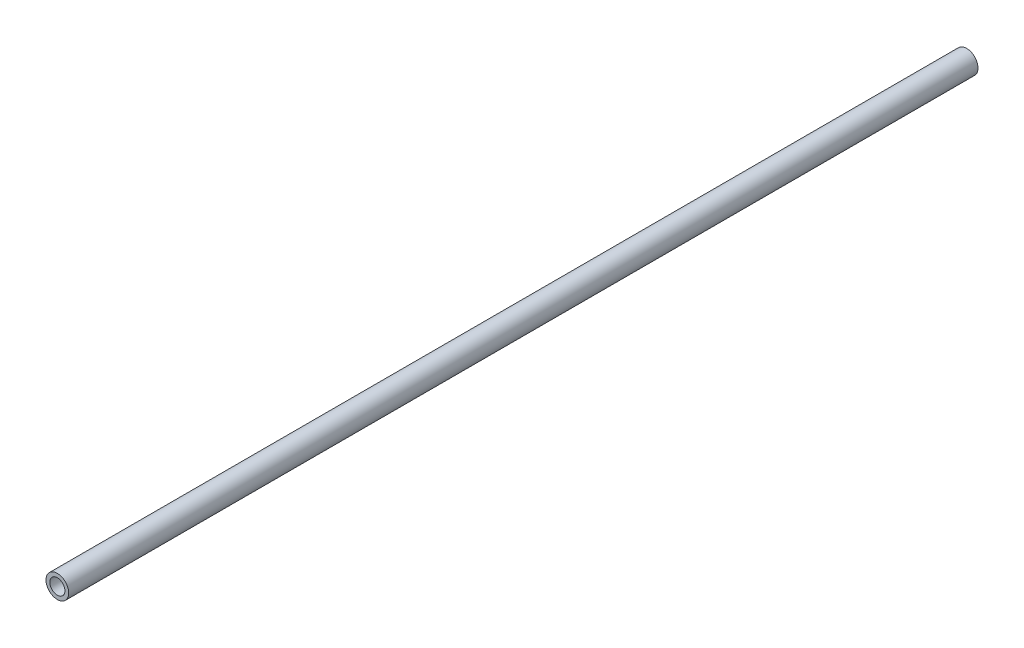
ISO-10303-21;
HEADER;
FILE_DESCRIPTION(('STEP AP214'),'2;1');
FILE_NAME('part.step','',(''),(''),'','','');
FILE_SCHEMA(('AUTOMOTIVE_DESIGN { 1 0 10303 214 1 1 1 1 }'));
ENDSEC;
DATA;
#1=APPLICATION_CONTEXT('core data for automotive mechanical design processes');
#2=APPLICATION_PROTOCOL_DEFINITION('international standard','automotive_design',2000,#1);
#3=PRODUCT_CONTEXT('',#1,'mechanical');
#4=PRODUCT('Part','Part','',(#3));
#5=PRODUCT_RELATED_PRODUCT_CATEGORY('part','',(#4));
#6=PRODUCT_DEFINITION_FORMATION('','',#4);
#7=PRODUCT_DEFINITION_CONTEXT('part definition',#1,'design');
#8=PRODUCT_DEFINITION('design','',#6,#7);
#9=PRODUCT_DEFINITION_SHAPE('','',#8);
#10=(LENGTH_UNIT() NAMED_UNIT(*) SI_UNIT(.MILLI.,.METRE.));
#11=(NAMED_UNIT(*) PLANE_ANGLE_UNIT() SI_UNIT($,.RADIAN.));
#12=(NAMED_UNIT(*) SI_UNIT($,.STERADIAN.) SOLID_ANGLE_UNIT());
#13=UNCERTAINTY_MEASURE_WITH_UNIT(LENGTH_MEASURE(1.E-05),#10,'distance_accuracy_value','');
#14=(GEOMETRIC_REPRESENTATION_CONTEXT(3) GLOBAL_UNCERTAINTY_ASSIGNED_CONTEXT((#13)) GLOBAL_UNIT_ASSIGNED_CONTEXT((#10,
#11,#12)) REPRESENTATION_CONTEXT('',''));
#15=CARTESIAN_POINT('',(0.,0.,0.));
#16=DIRECTION('',(0.,0.,1.));
#17=DIRECTION('',(1.,0.,0.));
#18=AXIS2_PLACEMENT_3D('',#15,#16,#17);
#19=CARTESIAN_POINT('',(0.,0.,609.6));
#20=DIRECTION('',(0.,0.,1.));
#21=DIRECTION('',(1.,0.,0.));
#22=AXIS2_PLACEMENT_3D('',#19,#20,#21);
#23=PLANE('',#22);
#24=CARTESIAN_POINT('',(0.,0.,609.6));
#25=DIRECTION('',(0.,0.,1.));
#26=DIRECTION('',(1.,0.,0.));
#27=AXIS2_PLACEMENT_3D('',#24,#25,#26);
#28=CIRCLE('',#27,7.62);
#29=CARTESIAN_POINT('',(7.62,0.,609.6));
#30=VERTEX_POINT('',#29);
#31=EDGE_CURVE('E10',#30,#30,#28,.T.);
#32=ORIENTED_EDGE('',*,*,#31,.T.);
#33=EDGE_LOOP('',(#32));
#34=FACE_BOUND('',#33,.T.);
#35=CARTESIAN_POINT('',(0.,0.,609.6));
#36=DIRECTION('',(0.,0.,1.));
#37=DIRECTION('',(1.,0.,0.));
#38=AXIS2_PLACEMENT_3D('',#35,#36,#37);
#39=CIRCLE('',#38,5.08);
#40=CARTESIAN_POINT('',(5.08,0.,609.6));
#41=VERTEX_POINT('',#40);
#42=EDGE_CURVE('E39',#41,#41,#39,.T.);
#43=ORIENTED_EDGE('',*,*,#42,.F.);
#44=EDGE_LOOP('',(#43));
#45=FACE_BOUND('',#44,.T.);
#46=ADVANCED_FACE('F28',(#34,#45),#23,.T.);
#47=CARTESIAN_POINT('',(0.,0.,0.));
#48=DIRECTION('',(0.,0.,1.));
#49=DIRECTION('',(1.,0.,0.));
#50=AXIS2_PLACEMENT_3D('',#47,#48,#49);
#51=PLANE('',#50);
#52=CARTESIAN_POINT('',(0.,0.,0.));
#53=DIRECTION('',(0.,0.,1.));
#54=DIRECTION('',(1.,0.,0.));
#55=AXIS2_PLACEMENT_3D('',#52,#53,#54);
#56=CIRCLE('',#55,7.62);
#57=CARTESIAN_POINT('',(7.62,0.,0.));
#58=VERTEX_POINT('',#57);
#59=EDGE_CURVE('E32',#58,#58,#56,.T.);
#60=ORIENTED_EDGE('',*,*,#59,.F.);
#61=EDGE_LOOP('',(#60));
#62=FACE_BOUND('',#61,.T.);
#63=CARTESIAN_POINT('',(0.,0.,0.));
#64=DIRECTION('',(0.,0.,1.));
#65=DIRECTION('',(1.,0.,0.));
#66=AXIS2_PLACEMENT_3D('',#63,#64,#65);
#67=CIRCLE('',#66,5.08);
#68=CARTESIAN_POINT('',(5.08,0.,0.));
#69=VERTEX_POINT('',#68);
#70=EDGE_CURVE('E41',#69,#69,#67,.T.);
#71=ORIENTED_EDGE('',*,*,#70,.T.);
#72=EDGE_LOOP('',(#71));
#73=FACE_BOUND('',#72,.T.);
#74=ADVANCED_FACE('F51',(#62,#73),#51,.F.);
#75=CARTESIAN_POINT('',(0.,0.,609.6));
#76=DIRECTION('',(0.,0.,-1.));
#77=DIRECTION('',(-1.,0.,0.));
#78=AXIS2_PLACEMENT_3D('',#75,#76,#77);
#79=CYLINDRICAL_SURFACE('',#78,7.62);
#80=ORIENTED_EDGE('',*,*,#31,.F.);
#81=EDGE_LOOP('',(#80));
#82=FACE_BOUND('',#81,.T.);
#83=ORIENTED_EDGE('',*,*,#59,.T.);
#84=EDGE_LOOP('',(#83));
#85=FACE_BOUND('',#84,.T.);
#86=ADVANCED_FACE('F30',(#82,#85),#79,.T.);
#87=CARTESIAN_POINT('',(0.,0.,609.6));
#88=DIRECTION('',(0.,0.,-1.));
#89=DIRECTION('',(-1.,0.,0.));
#90=AXIS2_PLACEMENT_3D('',#87,#88,#89);
#91=CYLINDRICAL_SURFACE('',#90,5.08);
#92=ORIENTED_EDGE('',*,*,#42,.T.);
#93=EDGE_LOOP('',(#92));
#94=FACE_BOUND('',#93,.T.);
#95=ORIENTED_EDGE('',*,*,#70,.F.);
#96=EDGE_LOOP('',(#95));
#97=FACE_BOUND('',#96,.T.);
#98=ADVANCED_FACE('F47',(#94,#97),#91,.F.);
#99=CLOSED_SHELL('',(#46,#74,#86,#98));
#100=MANIFOLD_SOLID_BREP('B2',#99);
#101=ADVANCED_BREP_SHAPE_REPRESENTATION('',(#18,#100),#14);
#102=SHAPE_DEFINITION_REPRESENTATION(#9,#101);
ENDSEC;
END-ISO-10303-21;
